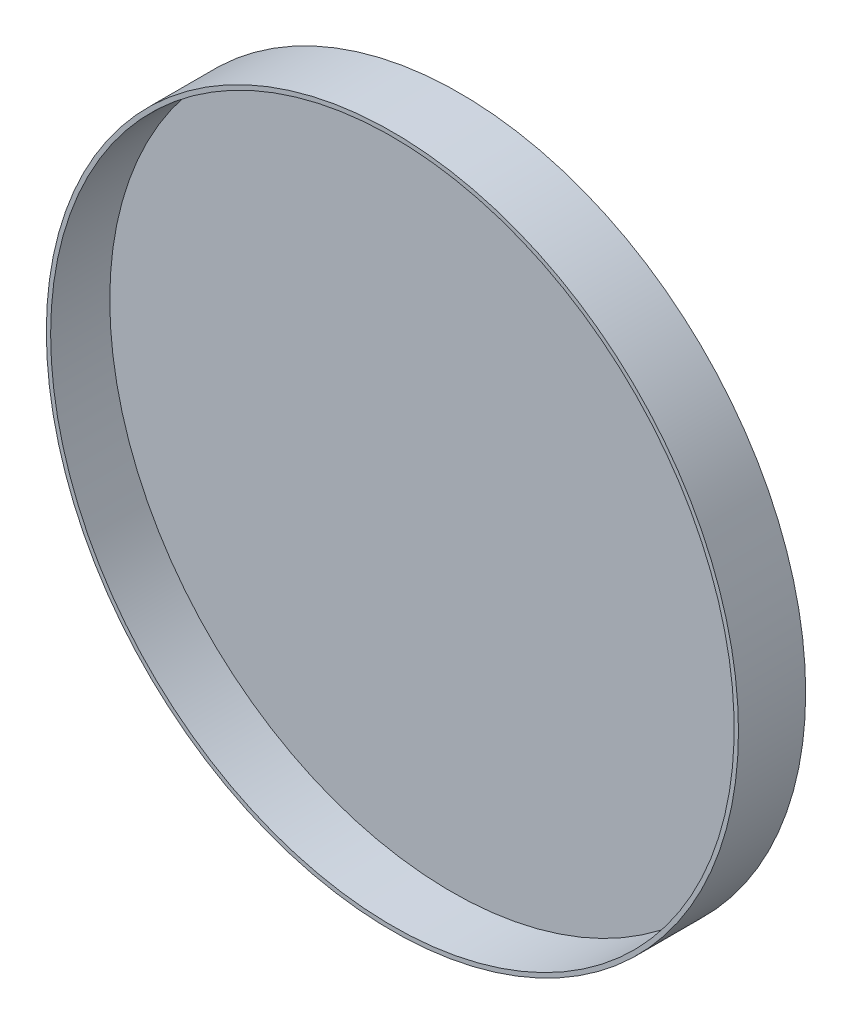
ISO-10303-21;
HEADER;
FILE_DESCRIPTION(('STEP AP214'),'2;1');
FILE_NAME('part.step','',(''),(''),'','','');
FILE_SCHEMA(('AUTOMOTIVE_DESIGN { 1 0 10303 214 1 1 1 1 }'));
ENDSEC;
DATA;
#1=APPLICATION_CONTEXT('core data for automotive mechanical design processes');
#2=APPLICATION_PROTOCOL_DEFINITION('international standard','automotive_design',2000,#1);
#3=PRODUCT_CONTEXT('',#1,'mechanical');
#4=PRODUCT('Part','Part','',(#3));
#5=PRODUCT_RELATED_PRODUCT_CATEGORY('part','',(#4));
#6=PRODUCT_DEFINITION_FORMATION('','',#4);
#7=PRODUCT_DEFINITION_CONTEXT('part definition',#1,'design');
#8=PRODUCT_DEFINITION('design','',#6,#7);
#9=PRODUCT_DEFINITION_SHAPE('','',#8);
#10=(LENGTH_UNIT() NAMED_UNIT(*) SI_UNIT(.MILLI.,.METRE.));
#11=(NAMED_UNIT(*) PLANE_ANGLE_UNIT() SI_UNIT($,.RADIAN.));
#12=(NAMED_UNIT(*) SI_UNIT($,.STERADIAN.) SOLID_ANGLE_UNIT());
#13=UNCERTAINTY_MEASURE_WITH_UNIT(LENGTH_MEASURE(1.E-05),#10,'distance_accuracy_value','');
#14=(GEOMETRIC_REPRESENTATION_CONTEXT(3) GLOBAL_UNCERTAINTY_ASSIGNED_CONTEXT((#13)) GLOBAL_UNIT_ASSIGNED_CONTEXT((#10,
#11,#12)) REPRESENTATION_CONTEXT('',''));
#15=CARTESIAN_POINT('',(0.,0.,0.));
#16=DIRECTION('',(0.,0.,1.));
#17=DIRECTION('',(1.,0.,0.));
#18=AXIS2_PLACEMENT_3D('',#15,#16,#17);
#19=CARTESIAN_POINT('',(0.,0.,0.));
#20=DIRECTION('',(0.,0.,-1.));
#21=DIRECTION('',(-1.,0.,0.));
#22=AXIS2_PLACEMENT_3D('',#19,#20,#21);
#23=PLANE('',#22);
#24=CARTESIAN_POINT('',(0.,0.,0.));
#25=DIRECTION('',(0.,0.,-1.));
#26=DIRECTION('',(-1.,0.,0.));
#27=AXIS2_PLACEMENT_3D('',#24,#25,#26);
#28=CIRCLE('',#27,32.2961);
#29=CARTESIAN_POINT('',(-32.2961,0.,0.));
#30=VERTEX_POINT('',#29);
#31=EDGE_CURVE('E18',#30,#30,#28,.F.);
#32=ORIENTED_EDGE('',*,*,#31,.T.);
#33=EDGE_LOOP('',(#32));
#34=FACE_BOUND('',#33,.T.);
#35=ADVANCED_FACE('F15',(#34),#23,.F.);
#36=CARTESIAN_POINT('',(0.,0.,5.588));
#37=DIRECTION('',(0.,0.,-1.));
#38=DIRECTION('',(-1.,0.,0.));
#39=AXIS2_PLACEMENT_3D('',#36,#37,#38);
#40=CYLINDRICAL_SURFACE('',#39,32.2961);
#41=CARTESIAN_POINT('',(0.,0.,5.588));
#42=DIRECTION('',(0.,0.,-1.));
#43=DIRECTION('',(-1.,0.,0.));
#44=AXIS2_PLACEMENT_3D('',#41,#42,#43);
#45=CIRCLE('',#44,32.2961);
#46=CARTESIAN_POINT('',(-32.2961,0.,5.588));
#47=VERTEX_POINT('',#46);
#48=EDGE_CURVE('E27',#47,#47,#45,.T.);
#49=ORIENTED_EDGE('',*,*,#48,.F.);
#50=EDGE_LOOP('',(#49));
#51=FACE_BOUND('',#50,.T.);
#52=ORIENTED_EDGE('',*,*,#31,.F.);
#53=EDGE_LOOP('',(#52));
#54=FACE_BOUND('',#53,.T.);
#55=ADVANCED_FACE('F36',(#51,#54),#40,.F.);
#56=CARTESIAN_POINT('',(0.,0.,5.588));
#57=DIRECTION('',(0.,0.,1.));
#58=DIRECTION('',(1.,0.,0.));
#59=AXIS2_PLACEMENT_3D('',#56,#57,#58);
#60=PLANE('',#59);
#61=ORIENTED_EDGE('',*,*,#48,.T.);
#62=EDGE_LOOP('',(#61));
#63=FACE_BOUND('',#62,.T.);
#64=CARTESIAN_POINT('',(0.,0.,5.588));
#65=DIRECTION('',(0.,0.,-1.));
#66=DIRECTION('',(-1.,0.,0.));
#67=AXIS2_PLACEMENT_3D('',#64,#65,#66);
#68=CIRCLE('',#67,32.7025);
#69=CARTESIAN_POINT('',(-32.7025,0.,5.588));
#70=VERTEX_POINT('',#69);
#71=EDGE_CURVE('E22',#70,#70,#68,.T.);
#72=ORIENTED_EDGE('',*,*,#71,.F.);
#73=EDGE_LOOP('',(#72));
#74=FACE_BOUND('',#73,.T.);
#75=ADVANCED_FACE('F38',(#63,#74),#60,.T.);
#76=CARTESIAN_POINT('',(0.,0.,5.588));
#77=DIRECTION('',(0.,0.,-1.));
#78=DIRECTION('',(-1.,0.,0.));
#79=AXIS2_PLACEMENT_3D('',#76,#77,#78);
#80=CYLINDRICAL_SURFACE('',#79,32.7025);
#81=ORIENTED_EDGE('',*,*,#71,.T.);
#82=EDGE_LOOP('',(#81));
#83=FACE_BOUND('',#82,.T.);
#84=CARTESIAN_POINT('',(0.,0.,-0.762));
#85=DIRECTION('',(0.,0.,-1.));
#86=DIRECTION('',(-1.,0.,0.));
#87=AXIS2_PLACEMENT_3D('',#84,#85,#86);
#88=CIRCLE('',#87,32.7025);
#89=CARTESIAN_POINT('',(-32.7025,0.,-0.762));
#90=VERTEX_POINT('',#89);
#91=EDGE_CURVE('E10',#90,#90,#88,.T.);
#92=ORIENTED_EDGE('',*,*,#91,.F.);
#93=EDGE_LOOP('',(#92));
#94=FACE_BOUND('',#93,.T.);
#95=ADVANCED_FACE('F45',(#83,#94),#80,.T.);
#96=CARTESIAN_POINT('',(0.,0.,-0.762));
#97=DIRECTION('',(0.,0.,-1.));
#98=DIRECTION('',(-1.,0.,0.));
#99=AXIS2_PLACEMENT_3D('',#96,#97,#98);
#100=PLANE('',#99);
#101=ORIENTED_EDGE('',*,*,#91,.T.);
#102=EDGE_LOOP('',(#101));
#103=FACE_BOUND('',#102,.T.);
#104=ADVANCED_FACE('F47',(#103),#100,.T.);
#105=CLOSED_SHELL('',(#35,#55,#75,#95,#104));
#106=MANIFOLD_SOLID_BREP('B1',#105);
#107=ADVANCED_BREP_SHAPE_REPRESENTATION('',(#18,#106),#14);
#108=SHAPE_DEFINITION_REPRESENTATION(#9,#107);
ENDSEC;
END-ISO-10303-21;
